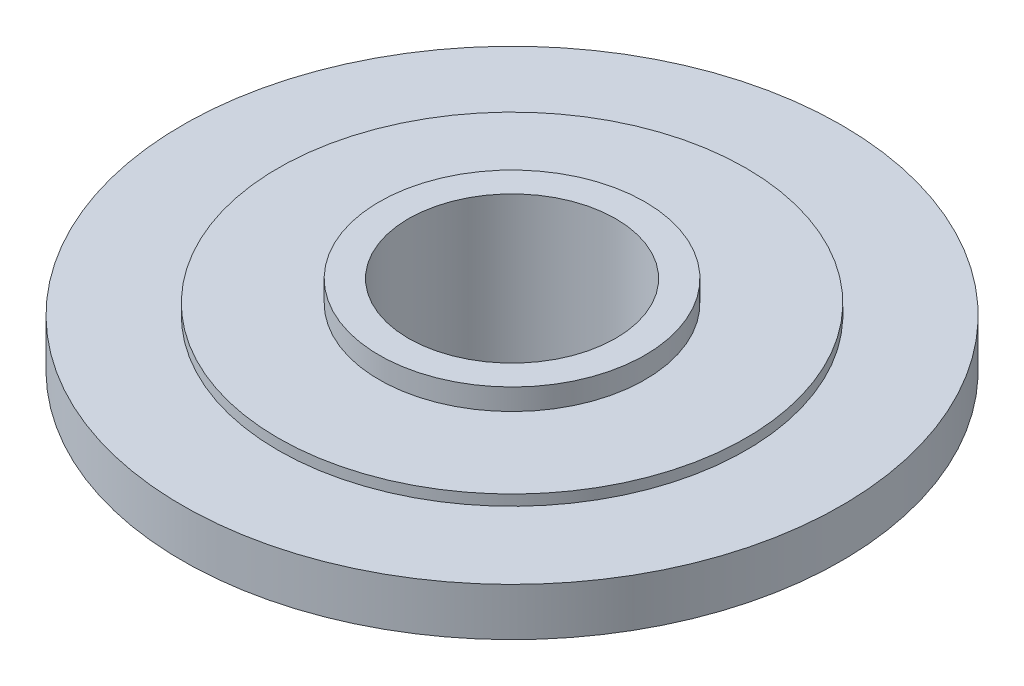
ISO-10303-21;
HEADER;
FILE_DESCRIPTION(('STEP AP214'),'2;1');
FILE_NAME('part.step','',(''),(''),'','','');
FILE_SCHEMA(('AUTOMOTIVE_DESIGN { 1 0 10303 214 1 1 1 1 }'));
ENDSEC;
DATA;
#1=APPLICATION_CONTEXT('core data for automotive mechanical design processes');
#2=APPLICATION_PROTOCOL_DEFINITION('international standard','automotive_design',2000,#1);
#3=PRODUCT_CONTEXT('',#1,'mechanical');
#4=PRODUCT('Part','Part','',(#3));
#5=PRODUCT_RELATED_PRODUCT_CATEGORY('part','',(#4));
#6=PRODUCT_DEFINITION_FORMATION('','',#4);
#7=PRODUCT_DEFINITION_CONTEXT('part definition',#1,'design');
#8=PRODUCT_DEFINITION('design','',#6,#7);
#9=PRODUCT_DEFINITION_SHAPE('','',#8);
#10=(LENGTH_UNIT() NAMED_UNIT(*) SI_UNIT(.MILLI.,.METRE.));
#11=(NAMED_UNIT(*) PLANE_ANGLE_UNIT() SI_UNIT($,.RADIAN.));
#12=(NAMED_UNIT(*) SI_UNIT($,.STERADIAN.) SOLID_ANGLE_UNIT());
#13=UNCERTAINTY_MEASURE_WITH_UNIT(LENGTH_MEASURE(1.E-05),#10,'distance_accuracy_value','');
#14=(GEOMETRIC_REPRESENTATION_CONTEXT(3) GLOBAL_UNCERTAINTY_ASSIGNED_CONTEXT((#13)) GLOBAL_UNIT_ASSIGNED_CONTEXT((#10,
#11,#12)) REPRESENTATION_CONTEXT('',''));
#15=CARTESIAN_POINT('',(0.,0.,0.));
#16=DIRECTION('',(0.,0.,1.));
#17=DIRECTION('',(1.,0.,0.));
#18=AXIS2_PLACEMENT_3D('',#15,#16,#17);
#19=CARTESIAN_POINT('',(0.,38.,0.));
#20=DIRECTION('',(0.,1.,0.));
#21=DIRECTION('',(0.,0.,1.));
#22=AXIS2_PLACEMENT_3D('',#19,#20,#21);
#23=PLANE('',#22);
#24=CARTESIAN_POINT('',(0.,38.,0.));
#25=DIRECTION('',(0.,1.,0.));
#26=DIRECTION('',(0.,0.,1.));
#27=AXIS2_PLACEMENT_3D('',#24,#25,#26);
#28=CIRCLE('',#27,19.5);
#29=CARTESIAN_POINT('',(0.,38.,19.5));
#30=VERTEX_POINT('',#29);
#31=EDGE_CURVE('E68',#30,#30,#28,.T.);
#32=ORIENTED_EDGE('',*,*,#31,.F.);
#33=EDGE_LOOP('',(#32));
#34=FACE_BOUND('',#33,.T.);
#35=CARTESIAN_POINT('',(0.,38.,0.));
#36=DIRECTION('',(0.,-1.,0.));
#37=DIRECTION('',(0.,0.,-1.));
#38=AXIS2_PLACEMENT_3D('',#35,#36,#37);
#39=CIRCLE('',#38,25.);
#40=CARTESIAN_POINT('',(0.,38.,-25.));
#41=VERTEX_POINT('',#40);
#42=EDGE_CURVE('E10',#41,#41,#39,.T.);
#43=ORIENTED_EDGE('',*,*,#42,.F.);
#44=EDGE_LOOP('',(#43));
#45=FACE_BOUND('',#44,.T.);
#46=ADVANCED_FACE('F31',(#34,#45),#23,.T.);
#47=CARTESIAN_POINT('',(0.,0.,0.));
#48=DIRECTION('',(0.,-1.,0.));
#49=DIRECTION('',(0.,0.,-1.));
#50=AXIS2_PLACEMENT_3D('',#47,#48,#49);
#51=CYLINDRICAL_SURFACE('',#50,25.);
#52=ORIENTED_EDGE('',*,*,#42,.T.);
#53=EDGE_LOOP('',(#52));
#54=FACE_BOUND('',#53,.T.);
#55=CARTESIAN_POINT('',(0.,34.,0.));
#56=DIRECTION('',(0.,-1.,0.));
#57=DIRECTION('',(0.,0.,-1.));
#58=AXIS2_PLACEMENT_3D('',#55,#56,#57);
#59=CIRCLE('',#58,25.);
#60=CARTESIAN_POINT('',(0.,34.,-25.));
#61=VERTEX_POINT('',#60);
#62=EDGE_CURVE('E38',#61,#61,#59,.T.);
#63=ORIENTED_EDGE('',*,*,#62,.F.);
#64=EDGE_LOOP('',(#63));
#65=FACE_BOUND('',#64,.T.);
#66=ADVANCED_FACE('F95',(#54,#65),#51,.T.);
#67=CARTESIAN_POINT('',(25.,34.,0.));
#68=DIRECTION('',(0.,1.,0.));
#69=DIRECTION('',(0.,0.,1.));
#70=AXIS2_PLACEMENT_3D('',#67,#68,#69);
#71=PLANE('',#70);
#72=ORIENTED_EDGE('',*,*,#62,.T.);
#73=EDGE_LOOP('',(#72));
#74=FACE_BOUND('',#73,.T.);
#75=CARTESIAN_POINT('',(0.,34.,0.));
#76=DIRECTION('',(0.,-1.,0.));
#77=DIRECTION('',(0.,0.,-1.));
#78=AXIS2_PLACEMENT_3D('',#75,#76,#77);
#79=CIRCLE('',#78,44.);
#80=CARTESIAN_POINT('',(0.,34.,-44.));
#81=VERTEX_POINT('',#80);
#82=EDGE_CURVE('E42',#81,#81,#79,.T.);
#83=ORIENTED_EDGE('',*,*,#82,.F.);
#84=EDGE_LOOP('',(#83));
#85=FACE_BOUND('',#84,.T.);
#86=ADVANCED_FACE('F100',(#74,#85),#71,.T.);
#87=CARTESIAN_POINT('',(0.,0.,0.));
#88=DIRECTION('',(0.,-1.,0.));
#89=DIRECTION('',(0.,0.,-1.));
#90=AXIS2_PLACEMENT_3D('',#87,#88,#89);
#91=CYLINDRICAL_SURFACE('',#90,44.);
#92=ORIENTED_EDGE('',*,*,#82,.T.);
#93=EDGE_LOOP('',(#92));
#94=FACE_BOUND('',#93,.T.);
#95=CARTESIAN_POINT('',(0.,32.,0.));
#96=DIRECTION('',(0.,-1.,0.));
#97=DIRECTION('',(0.,0.,-1.));
#98=AXIS2_PLACEMENT_3D('',#95,#96,#97);
#99=CIRCLE('',#98,44.);
#100=CARTESIAN_POINT('',(0.,32.,-44.));
#101=VERTEX_POINT('',#100);
#102=EDGE_CURVE('E47',#101,#101,#99,.T.);
#103=ORIENTED_EDGE('',*,*,#102,.F.);
#104=EDGE_LOOP('',(#103));
#105=FACE_BOUND('',#104,.T.);
#106=ADVANCED_FACE('F105',(#94,#105),#91,.T.);
#107=CARTESIAN_POINT('',(62.,32.,0.));
#108=DIRECTION('',(0.,1.,0.));
#109=DIRECTION('',(0.,0.,1.));
#110=AXIS2_PLACEMENT_3D('',#107,#108,#109);
#111=PLANE('',#110);
#112=ORIENTED_EDGE('',*,*,#102,.T.);
#113=EDGE_LOOP('',(#112));
#114=FACE_BOUND('',#113,.T.);
#115=CARTESIAN_POINT('',(0.,32.,0.));
#116=DIRECTION('',(0.,-1.,0.));
#117=DIRECTION('',(0.,0.,-1.));
#118=AXIS2_PLACEMENT_3D('',#115,#116,#117);
#119=CIRCLE('',#118,62.);
#120=CARTESIAN_POINT('',(0.,32.,-62.));
#121=VERTEX_POINT('',#120);
#122=EDGE_CURVE('E50',#121,#121,#119,.T.);
#123=ORIENTED_EDGE('',*,*,#122,.F.);
#124=EDGE_LOOP('',(#123));
#125=FACE_BOUND('',#124,.T.);
#126=ADVANCED_FACE('F112',(#114,#125),#111,.T.);
#127=CARTESIAN_POINT('',(0.,0.,0.));
#128=DIRECTION('',(0.,-1.,0.));
#129=DIRECTION('',(0.,0.,-1.));
#130=AXIS2_PLACEMENT_3D('',#127,#128,#129);
#131=CYLINDRICAL_SURFACE('',#130,62.);
#132=ORIENTED_EDGE('',*,*,#122,.T.);
#133=EDGE_LOOP('',(#132));
#134=FACE_BOUND('',#133,.T.);
#135=CARTESIAN_POINT('',(0.,23.,0.));
#136=DIRECTION('',(0.,-1.,0.));
#137=DIRECTION('',(0.,0.,-1.));
#138=AXIS2_PLACEMENT_3D('',#135,#136,#137);
#139=CIRCLE('',#138,62.);
#140=CARTESIAN_POINT('',(0.,23.,-62.));
#141=VERTEX_POINT('',#140);
#142=EDGE_CURVE('E53',#141,#141,#139,.T.);
#143=ORIENTED_EDGE('',*,*,#142,.F.);
#144=EDGE_LOOP('',(#143));
#145=FACE_BOUND('',#144,.T.);
#146=ADVANCED_FACE('F116',(#134,#145),#131,.T.);
#147=CARTESIAN_POINT('',(30.5,23.,0.));
#148=DIRECTION('',(0.,-1.,0.));
#149=DIRECTION('',(0.,0.,-1.));
#150=AXIS2_PLACEMENT_3D('',#147,#148,#149);
#151=PLANE('',#150);
#152=ORIENTED_EDGE('',*,*,#142,.T.);
#153=EDGE_LOOP('',(#152));
#154=FACE_BOUND('',#153,.T.);
#155=CARTESIAN_POINT('',(0.,23.,0.));
#156=DIRECTION('',(0.,-1.,0.));
#157=DIRECTION('',(0.,0.,-1.));
#158=AXIS2_PLACEMENT_3D('',#155,#156,#157);
#159=CIRCLE('',#158,30.5);
#160=CARTESIAN_POINT('',(0.,23.,-30.5));
#161=VERTEX_POINT('',#160);
#162=EDGE_CURVE('E56',#161,#161,#159,.T.);
#163=ORIENTED_EDGE('',*,*,#162,.F.);
#164=EDGE_LOOP('',(#163));
#165=FACE_BOUND('',#164,.T.);
#166=ADVANCED_FACE('F120',(#154,#165),#151,.T.);
#167=CARTESIAN_POINT('',(0.,0.,0.));
#168=DIRECTION('',(0.,-1.,0.));
#169=DIRECTION('',(0.,0.,-1.));
#170=AXIS2_PLACEMENT_3D('',#167,#168,#169);
#171=CYLINDRICAL_SURFACE('',#170,30.5);
#172=ORIENTED_EDGE('',*,*,#162,.T.);
#173=EDGE_LOOP('',(#172));
#174=FACE_BOUND('',#173,.T.);
#175=CARTESIAN_POINT('',(0.,20.,0.));
#176=DIRECTION('',(0.,-1.,0.));
#177=DIRECTION('',(0.,0.,-1.));
#178=AXIS2_PLACEMENT_3D('',#175,#176,#177);
#179=CIRCLE('',#178,30.5);
#180=CARTESIAN_POINT('',(0.,20.,-30.5));
#181=VERTEX_POINT('',#180);
#182=EDGE_CURVE('E59',#181,#181,#179,.T.);
#183=ORIENTED_EDGE('',*,*,#182,.F.);
#184=EDGE_LOOP('',(#183));
#185=FACE_BOUND('',#184,.T.);
#186=ADVANCED_FACE('F91',(#174,#185),#171,.T.);
#187=CARTESIAN_POINT('',(26.,20.,0.));
#188=DIRECTION('',(0.,-1.,0.));
#189=DIRECTION('',(0.,0.,-1.));
#190=AXIS2_PLACEMENT_3D('',#187,#188,#189);
#191=PLANE('',#190);
#192=ORIENTED_EDGE('',*,*,#182,.T.);
#193=EDGE_LOOP('',(#192));
#194=FACE_BOUND('',#193,.T.);
#195=CARTESIAN_POINT('',(0.,20.,0.));
#196=DIRECTION('',(0.,-1.,0.));
#197=DIRECTION('',(0.,0.,-1.));
#198=AXIS2_PLACEMENT_3D('',#195,#196,#197);
#199=CIRCLE('',#198,26.);
#200=CARTESIAN_POINT('',(0.,20.,-26.));
#201=VERTEX_POINT('',#200);
#202=EDGE_CURVE('E62',#201,#201,#199,.T.);
#203=ORIENTED_EDGE('',*,*,#202,.F.);
#204=EDGE_LOOP('',(#203));
#205=FACE_BOUND('',#204,.T.);
#206=ADVANCED_FACE('F85',(#194,#205),#191,.T.);
#207=CARTESIAN_POINT('',(0.,0.,0.));
#208=DIRECTION('',(0.,-1.,0.));
#209=DIRECTION('',(0.,0.,-1.));
#210=AXIS2_PLACEMENT_3D('',#207,#208,#209);
#211=CYLINDRICAL_SURFACE('',#210,26.);
#212=ORIENTED_EDGE('',*,*,#202,.T.);
#213=EDGE_LOOP('',(#212));
#214=FACE_BOUND('',#213,.T.);
#215=CARTESIAN_POINT('',(0.,0.,0.));
#216=DIRECTION('',(0.,-1.,0.));
#217=DIRECTION('',(0.,0.,-1.));
#218=AXIS2_PLACEMENT_3D('',#215,#216,#217);
#219=CIRCLE('',#218,26.);
#220=CARTESIAN_POINT('',(0.,0.,-26.));
#221=VERTEX_POINT('',#220);
#222=EDGE_CURVE('E65',#221,#221,#219,.T.);
#223=ORIENTED_EDGE('',*,*,#222,.F.);
#224=EDGE_LOOP('',(#223));
#225=FACE_BOUND('',#224,.T.);
#226=ADVANCED_FACE('F80',(#214,#225),#211,.T.);
#227=CARTESIAN_POINT('',(0.,0.,0.));
#228=DIRECTION('',(0.,-1.,0.));
#229=DIRECTION('',(0.,0.,-1.));
#230=AXIS2_PLACEMENT_3D('',#227,#228,#229);
#231=PLANE('',#230);
#232=CARTESIAN_POINT('',(0.,0.,0.));
#233=DIRECTION('',(0.,-1.,0.));
#234=DIRECTION('',(0.,0.,-1.));
#235=AXIS2_PLACEMENT_3D('',#232,#233,#234);
#236=CIRCLE('',#235,19.5);
#237=CARTESIAN_POINT('',(0.,0.,-19.5));
#238=VERTEX_POINT('',#237);
#239=EDGE_CURVE('E34',#238,#238,#236,.T.);
#240=ORIENTED_EDGE('',*,*,#239,.F.);
#241=EDGE_LOOP('',(#240));
#242=FACE_BOUND('',#241,.T.);
#243=ORIENTED_EDGE('',*,*,#222,.T.);
#244=EDGE_LOOP('',(#243));
#245=FACE_BOUND('',#244,.T.);
#246=ADVANCED_FACE('F77',(#242,#245),#231,.T.);
#247=CARTESIAN_POINT('',(0.,-12.,0.));
#248=DIRECTION('',(0.,1.,0.));
#249=DIRECTION('',(0.,0.,1.));
#250=AXIS2_PLACEMENT_3D('',#247,#248,#249);
#251=CYLINDRICAL_SURFACE('',#250,19.5);
#252=ORIENTED_EDGE('',*,*,#239,.T.);
#253=EDGE_LOOP('',(#252));
#254=FACE_BOUND('',#253,.T.);
#255=ORIENTED_EDGE('',*,*,#31,.T.);
#256=EDGE_LOOP('',(#255));
#257=FACE_BOUND('',#256,.T.);
#258=ADVANCED_FACE('F75',(#254,#257),#251,.F.);
#259=CLOSED_SHELL('',(#46,#66,#86,#106,#126,#146,#166,#186,#206,#226,#246,#258));
#260=MANIFOLD_SOLID_BREP('B2',#259);
#261=ADVANCED_BREP_SHAPE_REPRESENTATION('',(#18,#260),#14);
#262=SHAPE_DEFINITION_REPRESENTATION(#9,#261);
ENDSEC;
END-ISO-10303-21;
